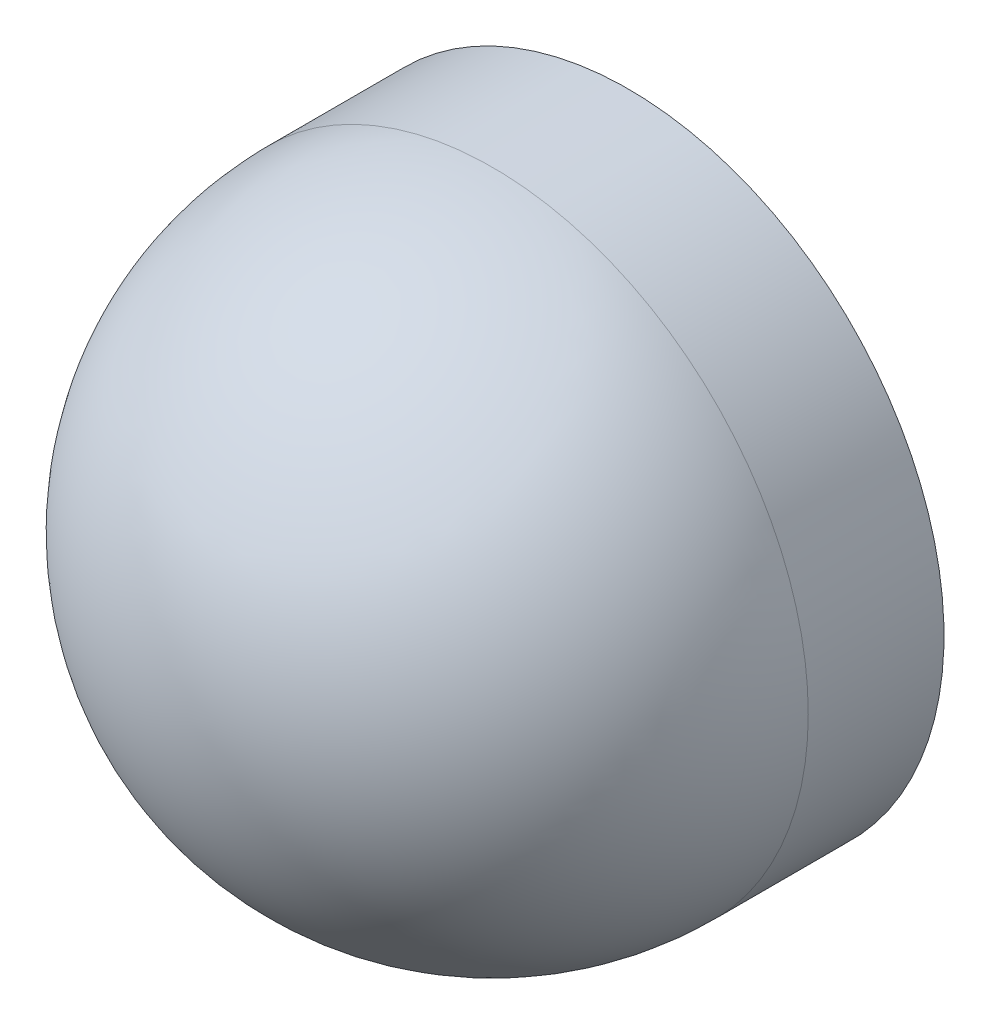
ISO-10303-21;
HEADER;
FILE_DESCRIPTION(('STEP AP214'),'2;1');
FILE_NAME('part.step','',(''),(''),'','','');
FILE_SCHEMA(('AUTOMOTIVE_DESIGN { 1 0 10303 214 1 1 1 1 }'));
ENDSEC;
DATA;
#1=APPLICATION_CONTEXT('core data for automotive mechanical design processes');
#2=APPLICATION_PROTOCOL_DEFINITION('international standard','automotive_design',2000,#1);
#3=PRODUCT_CONTEXT('',#1,'mechanical');
#4=PRODUCT('Part','Part','',(#3));
#5=PRODUCT_RELATED_PRODUCT_CATEGORY('part','',(#4));
#6=PRODUCT_DEFINITION_FORMATION('','',#4);
#7=PRODUCT_DEFINITION_CONTEXT('part definition',#1,'design');
#8=PRODUCT_DEFINITION('design','',#6,#7);
#9=PRODUCT_DEFINITION_SHAPE('','',#8);
#10=(LENGTH_UNIT() NAMED_UNIT(*) SI_UNIT(.MILLI.,.METRE.));
#11=(NAMED_UNIT(*) PLANE_ANGLE_UNIT() SI_UNIT($,.RADIAN.));
#12=(NAMED_UNIT(*) SI_UNIT($,.STERADIAN.) SOLID_ANGLE_UNIT());
#13=UNCERTAINTY_MEASURE_WITH_UNIT(LENGTH_MEASURE(1.E-05),#10,'distance_accuracy_value','');
#14=(GEOMETRIC_REPRESENTATION_CONTEXT(3) GLOBAL_UNCERTAINTY_ASSIGNED_CONTEXT((#13)) GLOBAL_UNIT_ASSIGNED_CONTEXT((#10,
#11,#12)) REPRESENTATION_CONTEXT('',''));
#15=CARTESIAN_POINT('',(0.,0.,0.));
#16=DIRECTION('',(0.,0.,1.));
#17=DIRECTION('',(1.,0.,0.));
#18=AXIS2_PLACEMENT_3D('',#15,#16,#17);
#19=CARTESIAN_POINT('',(0.,12.75,3.82));
#20=DIRECTION('',(0.,0.,1.));
#21=DIRECTION('',(0.,-1.,0.));
#22=AXIS2_PLACEMENT_3D('',#19,#20,#21);
#23=PLANE('',#22);
#24=CARTESIAN_POINT('',(0.,12.75,3.82));
#25=DIRECTION('',(0.,0.,-1.));
#26=DIRECTION('',(-1.,0.,0.));
#27=AXIS2_PLACEMENT_3D('',#24,#25,#26);
#28=CIRCLE('',#27,1.);
#29=CARTESIAN_POINT('',(-1.,12.75,3.82));
#30=VERTEX_POINT('',#29);
#31=EDGE_CURVE('E19',#30,#30,#28,.F.);
#32=ORIENTED_EDGE('',*,*,#31,.F.);
#33=EDGE_LOOP('',(#32));
#34=FACE_BOUND('',#33,.T.);
#35=ADVANCED_FACE('F16',(#34),#23,.F.);
#36=CARTESIAN_POINT('',(0.,12.75,5.25));
#37=DIRECTION('',(0.,0.,-1.));
#38=DIRECTION('',(-1.,0.,0.));
#39=AXIS2_PLACEMENT_3D('',#36,#37,#38);
#40=CYLINDRICAL_SURFACE('',#39,1.);
#41=CARTESIAN_POINT('',(0.,12.75,4.25));
#42=DIRECTION('',(0.,0.,-1.));
#43=DIRECTION('',(-1.,0.,0.));
#44=AXIS2_PLACEMENT_3D('',#41,#42,#43);
#45=CIRCLE('',#44,1.);
#46=CARTESIAN_POINT('',(-1.,12.75,4.25));
#47=VERTEX_POINT('',#46);
#48=CARTESIAN_POINT('',(1.,12.75,4.25));
#49=VERTEX_POINT('',#48);
#50=EDGE_CURVE('E24',#47,#49,#45,.F.);
#51=ORIENTED_EDGE('',*,*,#50,.F.);
#52=CARTESIAN_POINT('',(0.,12.75,4.25));
#53=DIRECTION('',(0.,0.,1.));
#54=DIRECTION('',(1.,0.,0.));
#55=AXIS2_PLACEMENT_3D('',#52,#53,#54);
#56=CIRCLE('',#55,1.);
#57=EDGE_CURVE('E10',#49,#47,#56,.T.);
#58=ORIENTED_EDGE('',*,*,#57,.F.);
#59=EDGE_LOOP('',(#51,#58));
#60=FACE_BOUND('',#59,.T.);
#61=ORIENTED_EDGE('',*,*,#31,.T.);
#62=EDGE_LOOP('',(#61));
#63=FACE_BOUND('',#62,.T.);
#64=ADVANCED_FACE('F31',(#60,#63),#40,.T.);
#65=CARTESIAN_POINT('',(0.,12.75,4.25));
#66=DIRECTION('',(1.,0.,0.));
#67=DIRECTION('',(0.,1.,0.));
#68=AXIS2_PLACEMENT_3D('',#65,#66,#67);
#69=SPHERICAL_SURFACE('',#68,1.);
#70=ORIENTED_EDGE('',*,*,#50,.T.);
#71=ORIENTED_EDGE('',*,*,#57,.T.);
#72=EDGE_LOOP('',(#70,#71));
#73=FACE_BOUND('',#72,.T.);
#74=ADVANCED_FACE('F34',(#73),#69,.T.);
#75=CLOSED_SHELL('',(#35,#64,#74));
#76=MANIFOLD_SOLID_BREP('B1',#75);
#77=ADVANCED_BREP_SHAPE_REPRESENTATION('',(#18,#76),#14);
#78=SHAPE_DEFINITION_REPRESENTATION(#9,#77);
ENDSEC;
END-ISO-10303-21;
